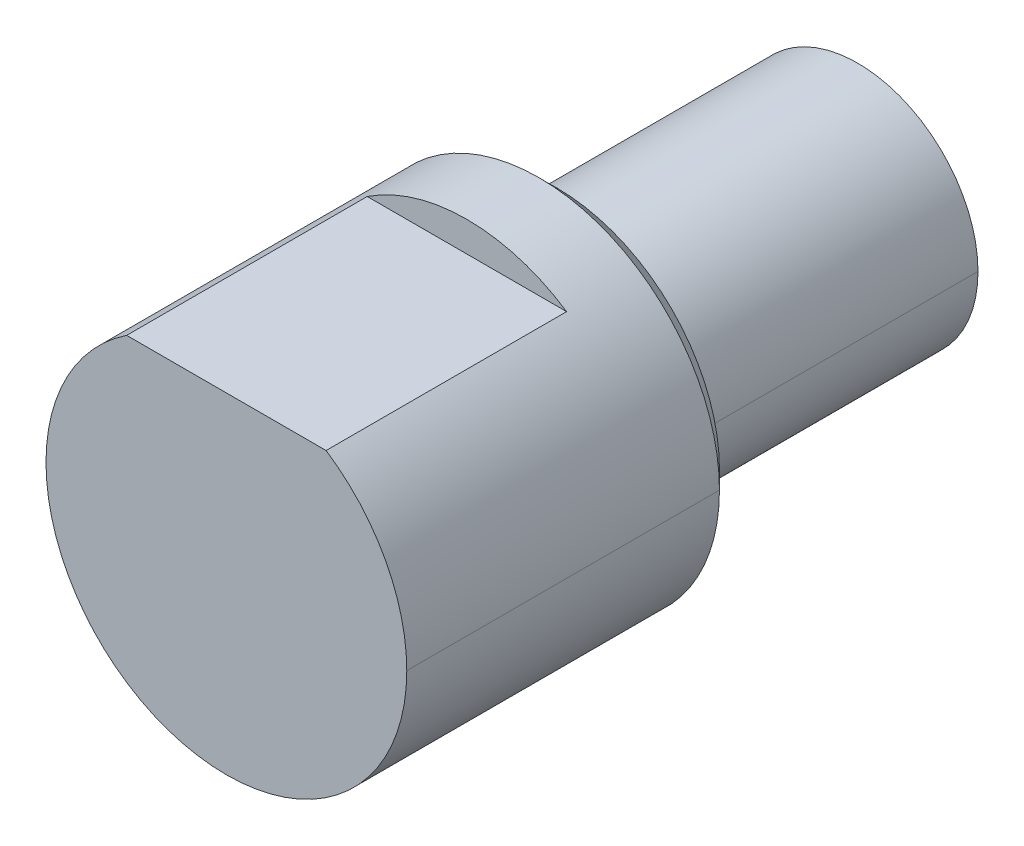
ISO-10303-21;
HEADER;
FILE_DESCRIPTION(('STEP AP214'),'2;1');
FILE_NAME('part.step','',(''),(''),'','','');
FILE_SCHEMA(('AUTOMOTIVE_DESIGN { 1 0 10303 214 1 1 1 1 }'));
ENDSEC;
DATA;
#1=APPLICATION_CONTEXT('core data for automotive mechanical design processes');
#2=APPLICATION_PROTOCOL_DEFINITION('international standard','automotive_design',2000,#1);
#3=PRODUCT_CONTEXT('',#1,'mechanical');
#4=PRODUCT('Part','Part','',(#3));
#5=PRODUCT_RELATED_PRODUCT_CATEGORY('part','',(#4));
#6=PRODUCT_DEFINITION_FORMATION('','',#4);
#7=PRODUCT_DEFINITION_CONTEXT('part definition',#1,'design');
#8=PRODUCT_DEFINITION('design','',#6,#7);
#9=PRODUCT_DEFINITION_SHAPE('','',#8);
#10=(LENGTH_UNIT() NAMED_UNIT(*) SI_UNIT(.MILLI.,.METRE.));
#11=(NAMED_UNIT(*) PLANE_ANGLE_UNIT() SI_UNIT($,.RADIAN.));
#12=(NAMED_UNIT(*) SI_UNIT($,.STERADIAN.) SOLID_ANGLE_UNIT());
#13=UNCERTAINTY_MEASURE_WITH_UNIT(LENGTH_MEASURE(1.E-05),#10,'distance_accuracy_value','');
#14=(GEOMETRIC_REPRESENTATION_CONTEXT(3) GLOBAL_UNCERTAINTY_ASSIGNED_CONTEXT((#13)) GLOBAL_UNIT_ASSIGNED_CONTEXT((#10,
#11,#12)) REPRESENTATION_CONTEXT('',''));
#15=CARTESIAN_POINT('',(0.,0.,0.));
#16=DIRECTION('',(0.,0.,1.));
#17=DIRECTION('',(1.,0.,0.));
#18=AXIS2_PLACEMENT_3D('',#15,#16,#17);
#19=CARTESIAN_POINT('',(0.,0.,-5.5));
#20=DIRECTION('',(0.,0.,1.));
#21=DIRECTION('',(1.,0.,0.));
#22=AXIS2_PLACEMENT_3D('',#19,#20,#21);
#23=CONICAL_SURFACE('',#22,2.7,0.785398163397449);
#24=DIRECTION('',(-0.707106781186548,0.,0.707106781186547));
#25=VECTOR('',#24,1.);
#26=CARTESIAN_POINT('',(-2.7,0.,-5.5));
#27=LINE('',#26,#25);
#28=CARTESIAN_POINT('',(-2.7,0.,-5.5));
#29=VERTEX_POINT('',#28);
#30=CARTESIAN_POINT('',(-3.,0.,-5.2));
#31=VERTEX_POINT('',#30);
#32=EDGE_CURVE('E168',#29,#31,#27,.T.);
#33=ORIENTED_EDGE('',*,*,#32,.F.);
#34=CARTESIAN_POINT('',(0.,0.,-5.5));
#35=DIRECTION('',(0.,0.,-1.));
#36=DIRECTION('',(-1.,0.,0.));
#37=AXIS2_PLACEMENT_3D('',#34,#35,#36);
#38=CIRCLE('',#37,2.7);
#39=CARTESIAN_POINT('',(2.7,0.,-5.5));
#40=VERTEX_POINT('',#39);
#41=EDGE_CURVE('E162',#40,#29,#38,.T.);
#42=ORIENTED_EDGE('',*,*,#41,.F.);
#43=DIRECTION('',(0.707106781186548,0.,0.707106781186547));
#44=VECTOR('',#43,1.);
#45=CARTESIAN_POINT('',(2.7,0.,-5.5));
#46=LINE('',#45,#44);
#47=CARTESIAN_POINT('',(3.,0.,-5.2));
#48=VERTEX_POINT('',#47);
#49=EDGE_CURVE('E158',#40,#48,#46,.T.);
#50=ORIENTED_EDGE('',*,*,#49,.T.);
#51=CARTESIAN_POINT('',(0.,0.,-5.2));
#52=DIRECTION('',(0.,0.,1.));
#53=DIRECTION('',(-1.,0.,0.));
#54=AXIS2_PLACEMENT_3D('',#51,#52,#53);
#55=CIRCLE('',#54,3.);
#56=EDGE_CURVE('E80',#31,#48,#55,.T.);
#57=ORIENTED_EDGE('',*,*,#56,.F.);
#58=EDGE_LOOP('',(#33,#42,#50,#57));
#59=FACE_BOUND('',#58,.T.);
#60=ADVANCED_FACE('F16',(#59),#23,.T.);
#61=CARTESIAN_POINT('',(-3.,2.5,0.));
#62=DIRECTION('',(0.,-1.,0.));
#63=DIRECTION('',(0.,0.,-1.));
#64=AXIS2_PLACEMENT_3D('',#61,#62,#63);
#65=PLANE('',#64);
#66=DIRECTION('',(0.,0.,1.));
#67=VECTOR('',#66,1.);
#68=CARTESIAN_POINT('',(-1.6583123951777,2.5,0.));
#69=LINE('',#68,#67);
#70=CARTESIAN_POINT('',(-1.6583123951777,2.5,-4.));
#71=VERTEX_POINT('',#70);
#72=CARTESIAN_POINT('',(-1.6583123951777,2.5,0.));
#73=VERTEX_POINT('',#72);
#74=EDGE_CURVE('E175',#71,#73,#69,.T.);
#75=ORIENTED_EDGE('',*,*,#74,.T.);
#76=DIRECTION('',(1.,0.,0.));
#77=VECTOR('',#76,1.);
#78=CARTESIAN_POINT('',(-3.,2.5,0.));
#79=LINE('',#78,#77);
#80=CARTESIAN_POINT('',(1.6583123951777,2.5,0.));
#81=VERTEX_POINT('',#80);
#82=EDGE_CURVE('E115',#73,#81,#79,.T.);
#83=ORIENTED_EDGE('',*,*,#82,.T.);
#84=DIRECTION('',(0.,0.,-1.));
#85=VECTOR('',#84,1.);
#86=CARTESIAN_POINT('',(1.6583123951777,2.5,0.));
#87=LINE('',#86,#85);
#88=CARTESIAN_POINT('',(1.6583123951777,2.5,-4.));
#89=VERTEX_POINT('',#88);
#90=EDGE_CURVE('E127',#81,#89,#87,.T.);
#91=ORIENTED_EDGE('',*,*,#90,.T.);
#92=DIRECTION('',(1.,0.,0.));
#93=VECTOR('',#92,1.);
#94=CARTESIAN_POINT('',(-3.,2.5,-4.));
#95=LINE('',#94,#93);
#96=EDGE_CURVE('E10',#71,#89,#95,.T.);
#97=ORIENTED_EDGE('',*,*,#96,.F.);
#98=EDGE_LOOP('',(#75,#83,#91,#97));
#99=FACE_BOUND('',#98,.T.);
#100=ADVANCED_FACE('F185',(#99),#65,.F.);
#101=CARTESIAN_POINT('',(-3.,3.,-4.));
#102=DIRECTION('',(0.,0.,-1.));
#103=DIRECTION('',(0.,-1.,0.));
#104=AXIS2_PLACEMENT_3D('',#101,#102,#103);
#105=PLANE('',#104);
#106=CARTESIAN_POINT('',(0.,0.,-4.));
#107=DIRECTION('',(0.,0.,1.));
#108=DIRECTION('',(-1.,0.,0.));
#109=AXIS2_PLACEMENT_3D('',#106,#107,#108);
#110=CIRCLE('',#109,3.);
#111=EDGE_CURVE('E178',#89,#71,#110,.T.);
#112=ORIENTED_EDGE('',*,*,#111,.T.);
#113=ORIENTED_EDGE('',*,*,#96,.T.);
#114=EDGE_LOOP('',(#112,#113));
#115=FACE_BOUND('',#114,.T.);
#116=ADVANCED_FACE('F230',(#115),#105,.F.);
#117=CARTESIAN_POINT('',(0.,2.,-10.5));
#118=DIRECTION('',(0.,0.,-1.));
#119=DIRECTION('',(0.,-1.,0.));
#120=AXIS2_PLACEMENT_3D('',#117,#118,#119);
#121=PLANE('',#120);
#122=CARTESIAN_POINT('',(0.,0.,-10.5));
#123=DIRECTION('',(0.,0.,-1.));
#124=DIRECTION('',(-1.,0.,0.));
#125=AXIS2_PLACEMENT_3D('',#122,#123,#124);
#126=CIRCLE('',#125,2.);
#127=CARTESIAN_POINT('',(-2.,0.,-10.5));
#128=VERTEX_POINT('',#127);
#129=CARTESIAN_POINT('',(2.,0.,-10.5));
#130=VERTEX_POINT('',#129);
#131=EDGE_CURVE('E136',#128,#130,#126,.T.);
#132=ORIENTED_EDGE('',*,*,#131,.T.);
#133=CARTESIAN_POINT('',(0.,0.,-10.5));
#134=DIRECTION('',(0.,0.,-1.));
#135=DIRECTION('',(-1.,0.,0.));
#136=AXIS2_PLACEMENT_3D('',#133,#134,#135);
#137=CIRCLE('',#136,2.);
#138=EDGE_CURVE('E27',#130,#128,#137,.T.);
#139=ORIENTED_EDGE('',*,*,#138,.T.);
#140=EDGE_LOOP('',(#132,#139));
#141=FACE_BOUND('',#140,.T.);
#142=ADVANCED_FACE('F210',(#141),#121,.T.);
#143=CARTESIAN_POINT('',(0.,0.,0.));
#144=DIRECTION('',(0.,0.,-1.));
#145=DIRECTION('',(-1.,0.,0.));
#146=AXIS2_PLACEMENT_3D('',#143,#144,#145);
#147=CYLINDRICAL_SURFACE('',#146,2.);
#148=DIRECTION('',(0.,0.,-1.));
#149=VECTOR('',#148,1.);
#150=CARTESIAN_POINT('',(2.,0.,0.));
#151=LINE('',#150,#149);
#152=CARTESIAN_POINT('',(2.,0.,-5.5));
#153=VERTEX_POINT('',#152);
#154=EDGE_CURVE('E142',#153,#130,#151,.T.);
#155=ORIENTED_EDGE('',*,*,#154,.F.);
#156=CARTESIAN_POINT('',(0.,0.,-5.5));
#157=DIRECTION('',(0.,0.,-1.));
#158=DIRECTION('',(-1.,0.,0.));
#159=AXIS2_PLACEMENT_3D('',#156,#157,#158);
#160=CIRCLE('',#159,2.);
#161=CARTESIAN_POINT('',(-2.,0.,-5.5));
#162=VERTEX_POINT('',#161);
#163=EDGE_CURVE('E55',#153,#162,#160,.T.);
#164=ORIENTED_EDGE('',*,*,#163,.T.);
#165=DIRECTION('',(0.,0.,-1.));
#166=VECTOR('',#165,1.);
#167=CARTESIAN_POINT('',(-2.,0.,0.));
#168=LINE('',#167,#166);
#169=EDGE_CURVE('E129',#162,#128,#168,.T.);
#170=ORIENTED_EDGE('',*,*,#169,.T.);
#171=ORIENTED_EDGE('',*,*,#138,.F.);
#172=EDGE_LOOP('',(#155,#164,#170,#171));
#173=FACE_BOUND('',#172,.T.);
#174=ADVANCED_FACE('F18',(#173),#147,.T.);
#175=CARTESIAN_POINT('',(0.,3.,-5.5));
#176=DIRECTION('',(0.,0.,-1.));
#177=DIRECTION('',(0.,-1.,0.));
#178=AXIS2_PLACEMENT_3D('',#175,#176,#177);
#179=PLANE('',#178);
#180=CARTESIAN_POINT('',(0.,0.,-5.5));
#181=DIRECTION('',(0.,0.,-1.));
#182=DIRECTION('',(-1.,0.,0.));
#183=AXIS2_PLACEMENT_3D('',#180,#181,#182);
#184=CIRCLE('',#183,2.);
#185=EDGE_CURVE('E150',#162,#153,#184,.T.);
#186=ORIENTED_EDGE('',*,*,#185,.F.);
#187=ORIENTED_EDGE('',*,*,#163,.F.);
#188=EDGE_LOOP('',(#186,#187));
#189=FACE_BOUND('',#188,.T.);
#190=ORIENTED_EDGE('',*,*,#41,.T.);
#191=CARTESIAN_POINT('',(0.,0.,-5.5));
#192=DIRECTION('',(0.,0.,-1.));
#193=DIRECTION('',(-1.,0.,0.));
#194=AXIS2_PLACEMENT_3D('',#191,#192,#193);
#195=CIRCLE('',#194,2.7);
#196=EDGE_CURVE('E20',#29,#40,#195,.T.);
#197=ORIENTED_EDGE('',*,*,#196,.T.);
#198=EDGE_LOOP('',(#190,#197));
#199=FACE_BOUND('',#198,.T.);
#200=ADVANCED_FACE('F238',(#189,#199),#179,.T.);
#201=CARTESIAN_POINT('',(0.,0.,0.));
#202=DIRECTION('',(0.,0.,-1.));
#203=DIRECTION('',(-1.,0.,0.));
#204=AXIS2_PLACEMENT_3D('',#201,#202,#203);
#205=CYLINDRICAL_SURFACE('',#204,3.);
#206=DIRECTION('',(0.,0.,-1.));
#207=VECTOR('',#206,1.);
#208=CARTESIAN_POINT('',(3.,0.,0.));
#209=LINE('',#208,#207);
#210=CARTESIAN_POINT('',(3.,0.,0.));
#211=VERTEX_POINT('',#210);
#212=EDGE_CURVE('E116',#211,#48,#209,.T.);
#213=ORIENTED_EDGE('',*,*,#212,.F.);
#214=CARTESIAN_POINT('',(0.,0.,0.));
#215=DIRECTION('',(0.,0.,-1.));
#216=DIRECTION('',(-1.,0.,0.));
#217=AXIS2_PLACEMENT_3D('',#214,#215,#216);
#218=CIRCLE('',#217,3.);
#219=CARTESIAN_POINT('',(-3.,0.,0.));
#220=VERTEX_POINT('',#219);
#221=EDGE_CURVE('E101',#211,#220,#218,.T.);
#222=ORIENTED_EDGE('',*,*,#221,.T.);
#223=DIRECTION('',(0.,0.,-1.));
#224=VECTOR('',#223,1.);
#225=CARTESIAN_POINT('',(-3.,0.,0.));
#226=LINE('',#225,#224);
#227=EDGE_CURVE('E122',#220,#31,#226,.T.);
#228=ORIENTED_EDGE('',*,*,#227,.T.);
#229=ORIENTED_EDGE('',*,*,#56,.T.);
#230=EDGE_LOOP('',(#213,#222,#228,#229));
#231=FACE_BOUND('',#230,.T.);
#232=ADVANCED_FACE('F117',(#231),#205,.T.);
#233=CARTESIAN_POINT('',(0.,0.,0.));
#234=DIRECTION('',(0.,0.,1.));
#235=DIRECTION('',(1.,0.,0.));
#236=AXIS2_PLACEMENT_3D('',#233,#234,#235);
#237=PLANE('',#236);
#238=ORIENTED_EDGE('',*,*,#82,.F.);
#239=CARTESIAN_POINT('',(0.,0.,0.));
#240=DIRECTION('',(0.,0.,-1.));
#241=DIRECTION('',(-1.,0.,0.));
#242=AXIS2_PLACEMENT_3D('',#239,#240,#241);
#243=CIRCLE('',#242,3.);
#244=EDGE_CURVE('E112',#220,#73,#243,.T.);
#245=ORIENTED_EDGE('',*,*,#244,.F.);
#246=ORIENTED_EDGE('',*,*,#221,.F.);
#247=CARTESIAN_POINT('',(0.,0.,0.));
#248=DIRECTION('',(0.,0.,-1.));
#249=DIRECTION('',(-1.,0.,0.));
#250=AXIS2_PLACEMENT_3D('',#247,#248,#249);
#251=CIRCLE('',#250,3.);
#252=EDGE_CURVE('E110',#81,#211,#251,.T.);
#253=ORIENTED_EDGE('',*,*,#252,.F.);
#254=EDGE_LOOP('',(#238,#245,#246,#253));
#255=FACE_BOUND('',#254,.T.);
#256=ADVANCED_FACE('F108',(#255),#237,.T.);
#257=CARTESIAN_POINT('',(0.,0.,0.));
#258=DIRECTION('',(0.,0.,-1.));
#259=DIRECTION('',(-1.,0.,0.));
#260=AXIS2_PLACEMENT_3D('',#257,#258,#259);
#261=CYLINDRICAL_SURFACE('',#260,3.);
#262=ORIENTED_EDGE('',*,*,#252,.T.);
#263=ORIENTED_EDGE('',*,*,#212,.T.);
#264=CARTESIAN_POINT('',(0.,0.,-5.2));
#265=DIRECTION('',(0.,0.,1.));
#266=DIRECTION('',(-1.,0.,0.));
#267=AXIS2_PLACEMENT_3D('',#264,#265,#266);
#268=CIRCLE('',#267,3.);
#269=EDGE_CURVE('E172',#48,#31,#268,.T.);
#270=ORIENTED_EDGE('',*,*,#269,.T.);
#271=ORIENTED_EDGE('',*,*,#227,.F.);
#272=ORIENTED_EDGE('',*,*,#244,.T.);
#273=ORIENTED_EDGE('',*,*,#74,.F.);
#274=ORIENTED_EDGE('',*,*,#111,.F.);
#275=ORIENTED_EDGE('',*,*,#90,.F.);
#276=EDGE_LOOP('',(#262,#263,#270,#271,#272,#273,#274,#275));
#277=FACE_BOUND('',#276,.T.);
#278=ADVANCED_FACE('F125',(#277),#261,.T.);
#279=CARTESIAN_POINT('',(0.,0.,0.));
#280=DIRECTION('',(0.,0.,-1.));
#281=DIRECTION('',(-1.,0.,0.));
#282=AXIS2_PLACEMENT_3D('',#279,#280,#281);
#283=CYLINDRICAL_SURFACE('',#282,2.);
#284=ORIENTED_EDGE('',*,*,#185,.T.);
#285=ORIENTED_EDGE('',*,*,#154,.T.);
#286=ORIENTED_EDGE('',*,*,#131,.F.);
#287=ORIENTED_EDGE('',*,*,#169,.F.);
#288=EDGE_LOOP('',(#284,#285,#286,#287));
#289=FACE_BOUND('',#288,.T.);
#290=ADVANCED_FACE('F213',(#289),#283,.T.);
#291=CARTESIAN_POINT('',(0.,0.,-5.5));
#292=DIRECTION('',(0.,0.,1.));
#293=DIRECTION('',(1.,0.,0.));
#294=AXIS2_PLACEMENT_3D('',#291,#292,#293);
#295=CONICAL_SURFACE('',#294,2.7,0.785398163397449);
#296=ORIENTED_EDGE('',*,*,#196,.F.);
#297=ORIENTED_EDGE('',*,*,#32,.T.);
#298=ORIENTED_EDGE('',*,*,#269,.F.);
#299=ORIENTED_EDGE('',*,*,#49,.F.);
#300=EDGE_LOOP('',(#296,#297,#298,#299));
#301=FACE_BOUND('',#300,.T.);
#302=ADVANCED_FACE('F196',(#301),#295,.T.);
#303=CLOSED_SHELL('',(#60,#100,#116,#142,#174,#200,#232,#256,#278,#290,#302));
#304=MANIFOLD_SOLID_BREP('B1',#303);
#305=ADVANCED_BREP_SHAPE_REPRESENTATION('',(#18,#304),#14);
#306=SHAPE_DEFINITION_REPRESENTATION(#9,#305);
ENDSEC;
END-ISO-10303-21;
